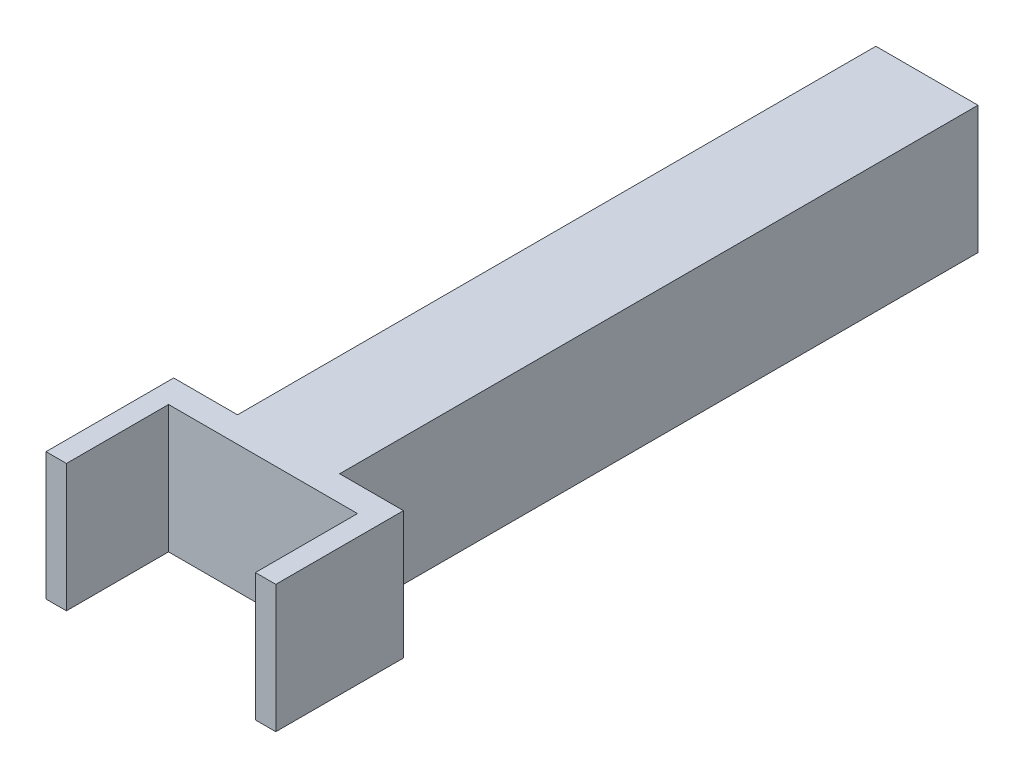
ISO-10303-21;
HEADER;
FILE_DESCRIPTION(('STEP AP214'),'2;1');
FILE_NAME('part.step','',(''),(''),'','','');
FILE_SCHEMA(('AUTOMOTIVE_DESIGN { 1 0 10303 214 1 1 1 1 }'));
ENDSEC;
DATA;
#1=APPLICATION_CONTEXT('core data for automotive mechanical design processes');
#2=APPLICATION_PROTOCOL_DEFINITION('international standard','automotive_design',2000,#1);
#3=PRODUCT_CONTEXT('',#1,'mechanical');
#4=PRODUCT('Part','Part','',(#3));
#5=PRODUCT_RELATED_PRODUCT_CATEGORY('part','',(#4));
#6=PRODUCT_DEFINITION_FORMATION('','',#4);
#7=PRODUCT_DEFINITION_CONTEXT('part definition',#1,'design');
#8=PRODUCT_DEFINITION('design','',#6,#7);
#9=PRODUCT_DEFINITION_SHAPE('','',#8);
#10=(LENGTH_UNIT() NAMED_UNIT(*) SI_UNIT(.MILLI.,.METRE.));
#11=(NAMED_UNIT(*) PLANE_ANGLE_UNIT() SI_UNIT($,.RADIAN.));
#12=(NAMED_UNIT(*) SI_UNIT($,.STERADIAN.) SOLID_ANGLE_UNIT());
#13=UNCERTAINTY_MEASURE_WITH_UNIT(LENGTH_MEASURE(1.E-05),#10,'distance_accuracy_value','');
#14=(GEOMETRIC_REPRESENTATION_CONTEXT(3) GLOBAL_UNCERTAINTY_ASSIGNED_CONTEXT((#13)) GLOBAL_UNIT_ASSIGNED_CONTEXT((#10,
#11,#12)) REPRESENTATION_CONTEXT('',''));
#15=CARTESIAN_POINT('',(0.,0.,0.));
#16=DIRECTION('',(0.,0.,1.));
#17=DIRECTION('',(1.,0.,0.));
#18=AXIS2_PLACEMENT_3D('',#15,#16,#17);
#19=CARTESIAN_POINT('',(0.,0.,260.));
#20=DIRECTION('',(0.,0.,-1.));
#21=DIRECTION('',(-1.,0.,0.));
#22=AXIS2_PLACEMENT_3D('',#19,#20,#21);
#23=PLANE('',#22);
#24=DIRECTION('',(0.,-1.,0.));
#25=VECTOR('',#24,1.);
#26=CARTESIAN_POINT('',(37.,25.,260.));
#27=LINE('',#26,#25);
#28=CARTESIAN_POINT('',(37.,25.,260.));
#29=VERTEX_POINT('',#28);
#30=CARTESIAN_POINT('',(37.,-25.,260.));
#31=VERTEX_POINT('',#30);
#32=EDGE_CURVE('E52',#29,#31,#27,.T.);
#33=ORIENTED_EDGE('',*,*,#32,.F.);
#34=DIRECTION('',(-1.,0.,0.));
#35=VECTOR('',#34,1.);
#36=CARTESIAN_POINT('',(45.,25.,260.));
#37=LINE('',#36,#35);
#38=CARTESIAN_POINT('',(-37.,25.,260.));
#39=VERTEX_POINT('',#38);
#40=EDGE_CURVE('E143',#29,#39,#37,.T.);
#41=ORIENTED_EDGE('',*,*,#40,.T.);
#42=DIRECTION('',(0.,1.,0.));
#43=VECTOR('',#42,1.);
#44=CARTESIAN_POINT('',(-37.,25.,260.));
#45=LINE('',#44,#43);
#46=CARTESIAN_POINT('',(-37.,-25.,260.));
#47=VERTEX_POINT('',#46);
#48=EDGE_CURVE('E144',#47,#39,#45,.T.);
#49=ORIENTED_EDGE('',*,*,#48,.F.);
#50=DIRECTION('',(1.,0.,0.));
#51=VECTOR('',#50,1.);
#52=CARTESIAN_POINT('',(45.,-25.,260.));
#53=LINE('',#52,#51);
#54=EDGE_CURVE('E48',#47,#31,#53,.T.);
#55=ORIENTED_EDGE('',*,*,#54,.T.);
#56=EDGE_LOOP('',(#33,#41,#49,#55));
#57=FACE_BOUND('',#56,.T.);
#58=ADVANCED_FACE('F33',(#57),#23,.F.);
#59=CARTESIAN_POINT('',(-20.,25.,250.));
#60=DIRECTION('',(1.,0.,0.));
#61=DIRECTION('',(0.,1.,0.));
#62=AXIS2_PLACEMENT_3D('',#59,#60,#61);
#63=PLANE('',#62);
#64=DIRECTION('',(0.,-1.,0.));
#65=VECTOR('',#64,1.);
#66=CARTESIAN_POINT('',(-20.,25.,0.));
#67=LINE('',#66,#65);
#68=CARTESIAN_POINT('',(-20.,25.,0.));
#69=VERTEX_POINT('',#68);
#70=CARTESIAN_POINT('',(-20.,-25.,0.));
#71=VERTEX_POINT('',#70);
#72=EDGE_CURVE('E192',#69,#71,#67,.T.);
#73=ORIENTED_EDGE('',*,*,#72,.T.);
#74=DIRECTION('',(0.,0.,-1.));
#75=VECTOR('',#74,1.);
#76=CARTESIAN_POINT('',(-20.,-25.,250.));
#77=LINE('',#76,#75);
#78=CARTESIAN_POINT('',(-20.,-25.,250.));
#79=VERTEX_POINT('',#78);
#80=EDGE_CURVE('E11',#79,#71,#77,.T.);
#81=ORIENTED_EDGE('',*,*,#80,.F.);
#82=DIRECTION('',(0.,-1.,0.));
#83=VECTOR('',#82,1.);
#84=CARTESIAN_POINT('',(-20.,25.,250.));
#85=LINE('',#84,#83);
#86=CARTESIAN_POINT('',(-20.,25.,250.));
#87=VERTEX_POINT('',#86);
#88=EDGE_CURVE('E193',#87,#79,#85,.T.);
#89=ORIENTED_EDGE('',*,*,#88,.F.);
#90=DIRECTION('',(0.,0.,-1.));
#91=VECTOR('',#90,1.);
#92=CARTESIAN_POINT('',(-20.,25.,250.));
#93=LINE('',#92,#91);
#94=EDGE_CURVE('E200',#87,#69,#93,.T.);
#95=ORIENTED_EDGE('',*,*,#94,.T.);
#96=EDGE_LOOP('',(#73,#81,#89,#95));
#97=FACE_BOUND('',#96,.T.);
#98=ADVANCED_FACE('F35',(#97),#63,.F.);
#99=CARTESIAN_POINT('',(20.,-25.,250.));
#100=DIRECTION('',(0.,1.,0.));
#101=DIRECTION('',(-1.,0.,0.));
#102=AXIS2_PLACEMENT_3D('',#99,#100,#101);
#103=PLANE('',#102);
#104=DIRECTION('',(1.,0.,0.));
#105=VECTOR('',#104,1.);
#106=CARTESIAN_POINT('',(20.,-25.,0.));
#107=LINE('',#106,#105);
#108=CARTESIAN_POINT('',(20.,-25.,0.));
#109=VERTEX_POINT('',#108);
#110=EDGE_CURVE('E203',#71,#109,#107,.T.);
#111=ORIENTED_EDGE('',*,*,#110,.T.);
#112=DIRECTION('',(0.,0.,-1.));
#113=VECTOR('',#112,1.);
#114=CARTESIAN_POINT('',(20.,-25.,250.));
#115=LINE('',#114,#113);
#116=CARTESIAN_POINT('',(20.,-25.,250.));
#117=VERTEX_POINT('',#116);
#118=EDGE_CURVE('E41',#117,#109,#115,.T.);
#119=ORIENTED_EDGE('',*,*,#118,.F.);
#120=DIRECTION('',(1.,0.,0.));
#121=VECTOR('',#120,1.);
#122=CARTESIAN_POINT('',(45.,-25.,250.));
#123=LINE('',#122,#121);
#124=CARTESIAN_POINT('',(45.,-25.,250.));
#125=VERTEX_POINT('',#124);
#126=EDGE_CURVE('E173',#117,#125,#123,.T.);
#127=ORIENTED_EDGE('',*,*,#126,.T.);
#128=DIRECTION('',(0.,0.,-1.));
#129=VECTOR('',#128,1.);
#130=CARTESIAN_POINT('',(45.,-25.,260.));
#131=LINE('',#130,#129);
#132=CARTESIAN_POINT('',(45.,-25.,300.));
#133=VERTEX_POINT('',#132);
#134=EDGE_CURVE('E186',#133,#125,#131,.T.);
#135=ORIENTED_EDGE('',*,*,#134,.F.);
#136=DIRECTION('',(1.,0.,0.));
#137=VECTOR('',#136,1.);
#138=CARTESIAN_POINT('',(45.,-25.,300.));
#139=LINE('',#138,#137);
#140=CARTESIAN_POINT('',(37.,-25.,300.));
#141=VERTEX_POINT('',#140);
#142=EDGE_CURVE('E130',#141,#133,#139,.T.);
#143=ORIENTED_EDGE('',*,*,#142,.F.);
#144=DIRECTION('',(0.,0.,-1.));
#145=VECTOR('',#144,1.);
#146=CARTESIAN_POINT('',(37.,-25.,300.));
#147=LINE('',#146,#145);
#148=EDGE_CURVE('E126',#141,#31,#147,.T.);
#149=ORIENTED_EDGE('',*,*,#148,.T.);
#150=ORIENTED_EDGE('',*,*,#54,.F.);
#151=DIRECTION('',(0.,0.,-1.));
#152=VECTOR('',#151,1.);
#153=CARTESIAN_POINT('',(-37.,-25.,300.));
#154=LINE('',#153,#152);
#155=CARTESIAN_POINT('',(-37.,-25.,300.));
#156=VERTEX_POINT('',#155);
#157=EDGE_CURVE('E163',#156,#47,#154,.T.);
#158=ORIENTED_EDGE('',*,*,#157,.F.);
#159=DIRECTION('',(1.,0.,0.));
#160=VECTOR('',#159,1.);
#161=CARTESIAN_POINT('',(-45.,-25.,300.));
#162=LINE('',#161,#160);
#163=CARTESIAN_POINT('',(-45.,-25.,300.));
#164=VERTEX_POINT('',#163);
#165=EDGE_CURVE('E154',#164,#156,#162,.T.);
#166=ORIENTED_EDGE('',*,*,#165,.F.);
#167=DIRECTION('',(0.,0.,-1.));
#168=VECTOR('',#167,1.);
#169=CARTESIAN_POINT('',(-45.,-25.,260.));
#170=LINE('',#169,#168);
#171=CARTESIAN_POINT('',(-45.,-25.,250.));
#172=VERTEX_POINT('',#171);
#173=EDGE_CURVE('E189',#164,#172,#170,.T.);
#174=ORIENTED_EDGE('',*,*,#173,.T.);
#175=EDGE_CURVE('E174',#172,#79,#123,.T.);
#176=ORIENTED_EDGE('',*,*,#175,.T.);
#177=ORIENTED_EDGE('',*,*,#80,.T.);
#178=EDGE_LOOP('',(#111,#119,#127,#135,#143,#149,#150,#158,#166,#174,#176,#177));
#179=FACE_BOUND('',#178,.T.);
#180=ADVANCED_FACE('F241',(#179),#103,.F.);
#181=CARTESIAN_POINT('',(20.,25.,250.));
#182=DIRECTION('',(-1.,0.,0.));
#183=DIRECTION('',(0.,-1.,0.));
#184=AXIS2_PLACEMENT_3D('',#181,#182,#183);
#185=PLANE('',#184);
#186=DIRECTION('',(0.,1.,0.));
#187=VECTOR('',#186,1.);
#188=CARTESIAN_POINT('',(20.,25.,0.));
#189=LINE('',#188,#187);
#190=CARTESIAN_POINT('',(20.,25.,0.));
#191=VERTEX_POINT('',#190);
#192=EDGE_CURVE('E205',#109,#191,#189,.T.);
#193=ORIENTED_EDGE('',*,*,#192,.T.);
#194=DIRECTION('',(0.,0.,-1.));
#195=VECTOR('',#194,1.);
#196=CARTESIAN_POINT('',(20.,25.,250.));
#197=LINE('',#196,#195);
#198=CARTESIAN_POINT('',(20.,25.,250.));
#199=VERTEX_POINT('',#198);
#200=EDGE_CURVE('E210',#199,#191,#197,.T.);
#201=ORIENTED_EDGE('',*,*,#200,.F.);
#202=DIRECTION('',(0.,1.,0.));
#203=VECTOR('',#202,1.);
#204=CARTESIAN_POINT('',(20.,25.,250.));
#205=LINE('',#204,#203);
#206=EDGE_CURVE('E196',#117,#199,#205,.T.);
#207=ORIENTED_EDGE('',*,*,#206,.F.);
#208=ORIENTED_EDGE('',*,*,#118,.T.);
#209=EDGE_LOOP('',(#193,#201,#207,#208));
#210=FACE_BOUND('',#209,.T.);
#211=ADVANCED_FACE('F216',(#210),#185,.F.);
#212=CARTESIAN_POINT('',(20.,25.,250.));
#213=DIRECTION('',(0.,-1.,0.));
#214=DIRECTION('',(1.,0.,0.));
#215=AXIS2_PLACEMENT_3D('',#212,#213,#214);
#216=PLANE('',#215);
#217=DIRECTION('',(-1.,0.,0.));
#218=VECTOR('',#217,1.);
#219=CARTESIAN_POINT('',(20.,25.,0.));
#220=LINE('',#219,#218);
#221=EDGE_CURVE('E197',#191,#69,#220,.T.);
#222=ORIENTED_EDGE('',*,*,#221,.T.);
#223=ORIENTED_EDGE('',*,*,#94,.F.);
#224=DIRECTION('',(-1.,0.,0.));
#225=VECTOR('',#224,1.);
#226=CARTESIAN_POINT('',(45.,25.,250.));
#227=LINE('',#226,#225);
#228=CARTESIAN_POINT('',(-45.,25.,250.));
#229=VERTEX_POINT('',#228);
#230=EDGE_CURVE('E179',#87,#229,#227,.T.);
#231=ORIENTED_EDGE('',*,*,#230,.T.);
#232=DIRECTION('',(0.,0.,-1.));
#233=VECTOR('',#232,1.);
#234=CARTESIAN_POINT('',(-45.,25.,260.));
#235=LINE('',#234,#233);
#236=CARTESIAN_POINT('',(-45.,25.,300.));
#237=VERTEX_POINT('',#236);
#238=EDGE_CURVE('E170',#237,#229,#235,.T.);
#239=ORIENTED_EDGE('',*,*,#238,.F.);
#240=DIRECTION('',(-1.,0.,0.));
#241=VECTOR('',#240,1.);
#242=CARTESIAN_POINT('',(-45.,25.,300.));
#243=LINE('',#242,#241);
#244=CARTESIAN_POINT('',(-37.,25.,300.));
#245=VERTEX_POINT('',#244);
#246=EDGE_CURVE('E158',#245,#237,#243,.T.);
#247=ORIENTED_EDGE('',*,*,#246,.F.);
#248=DIRECTION('',(0.,0.,-1.));
#249=VECTOR('',#248,1.);
#250=CARTESIAN_POINT('',(-37.,25.,300.));
#251=LINE('',#250,#249);
#252=EDGE_CURVE('E160',#245,#39,#251,.T.);
#253=ORIENTED_EDGE('',*,*,#252,.T.);
#254=ORIENTED_EDGE('',*,*,#40,.F.);
#255=DIRECTION('',(0.,0.,-1.));
#256=VECTOR('',#255,1.);
#257=CARTESIAN_POINT('',(37.,25.,300.));
#258=LINE('',#257,#256);
#259=CARTESIAN_POINT('',(37.,25.,300.));
#260=VERTEX_POINT('',#259);
#261=EDGE_CURVE('E124',#260,#29,#258,.T.);
#262=ORIENTED_EDGE('',*,*,#261,.F.);
#263=DIRECTION('',(-1.,0.,0.));
#264=VECTOR('',#263,1.);
#265=CARTESIAN_POINT('',(45.,25.,300.));
#266=LINE('',#265,#264);
#267=CARTESIAN_POINT('',(45.,25.,300.));
#268=VERTEX_POINT('',#267);
#269=EDGE_CURVE('E131',#268,#260,#266,.T.);
#270=ORIENTED_EDGE('',*,*,#269,.F.);
#271=DIRECTION('',(0.,0.,-1.));
#272=VECTOR('',#271,1.);
#273=CARTESIAN_POINT('',(45.,25.,260.));
#274=LINE('',#273,#272);
#275=CARTESIAN_POINT('',(45.,25.,250.));
#276=VERTEX_POINT('',#275);
#277=EDGE_CURVE('E184',#268,#276,#274,.T.);
#278=ORIENTED_EDGE('',*,*,#277,.T.);
#279=EDGE_CURVE('E168',#276,#199,#227,.T.);
#280=ORIENTED_EDGE('',*,*,#279,.T.);
#281=ORIENTED_EDGE('',*,*,#200,.T.);
#282=EDGE_LOOP('',(#222,#223,#231,#239,#247,#253,#254,#262,#270,#278,#280,#281));
#283=FACE_BOUND('',#282,.T.);
#284=ADVANCED_FACE('F141',(#283),#216,.F.);
#285=CARTESIAN_POINT('',(0.,0.,0.));
#286=DIRECTION('',(0.,0.,-1.));
#287=DIRECTION('',(-1.,0.,0.));
#288=AXIS2_PLACEMENT_3D('',#285,#286,#287);
#289=PLANE('',#288);
#290=ORIENTED_EDGE('',*,*,#72,.F.);
#291=ORIENTED_EDGE('',*,*,#221,.F.);
#292=ORIENTED_EDGE('',*,*,#192,.F.);
#293=ORIENTED_EDGE('',*,*,#110,.F.);
#294=EDGE_LOOP('',(#290,#291,#292,#293));
#295=FACE_BOUND('',#294,.T.);
#296=ADVANCED_FACE('F222',(#295),#289,.T.);
#297=CARTESIAN_POINT('',(0.,0.,250.));
#298=DIRECTION('',(0.,0.,-1.));
#299=DIRECTION('',(-1.,0.,0.));
#300=AXIS2_PLACEMENT_3D('',#297,#298,#299);
#301=PLANE('',#300);
#302=ORIENTED_EDGE('',*,*,#230,.F.);
#303=ORIENTED_EDGE('',*,*,#88,.T.);
#304=ORIENTED_EDGE('',*,*,#175,.F.);
#305=DIRECTION('',(0.,-1.,0.));
#306=VECTOR('',#305,1.);
#307=CARTESIAN_POINT('',(-45.,25.,250.));
#308=LINE('',#307,#306);
#309=EDGE_CURVE('E166',#229,#172,#308,.T.);
#310=ORIENTED_EDGE('',*,*,#309,.F.);
#311=EDGE_LOOP('',(#302,#303,#304,#310));
#312=FACE_BOUND('',#311,.T.);
#313=ADVANCED_FACE('F228',(#312),#301,.T.);
#314=CARTESIAN_POINT('',(-45.,25.,260.));
#315=DIRECTION('',(1.,0.,0.));
#316=DIRECTION('',(0.,1.,0.));
#317=AXIS2_PLACEMENT_3D('',#314,#315,#316);
#318=PLANE('',#317);
#319=ORIENTED_EDGE('',*,*,#309,.T.);
#320=ORIENTED_EDGE('',*,*,#173,.F.);
#321=DIRECTION('',(0.,-1.,0.));
#322=VECTOR('',#321,1.);
#323=CARTESIAN_POINT('',(-45.,25.,300.));
#324=LINE('',#323,#322);
#325=EDGE_CURVE('E147',#237,#164,#324,.T.);
#326=ORIENTED_EDGE('',*,*,#325,.F.);
#327=ORIENTED_EDGE('',*,*,#238,.T.);
#328=EDGE_LOOP('',(#319,#320,#326,#327));
#329=FACE_BOUND('',#328,.T.);
#330=ADVANCED_FACE('F232',(#329),#318,.F.);
#331=CARTESIAN_POINT('',(45.,25.,260.));
#332=DIRECTION('',(-1.,0.,0.));
#333=DIRECTION('',(0.,0.,1.));
#334=AXIS2_PLACEMENT_3D('',#331,#332,#333);
#335=PLANE('',#334);
#336=DIRECTION('',(0.,1.,0.));
#337=VECTOR('',#336,1.);
#338=CARTESIAN_POINT('',(45.,25.,250.));
#339=LINE('',#338,#337);
#340=EDGE_CURVE('E177',#125,#276,#339,.T.);
#341=ORIENTED_EDGE('',*,*,#340,.T.);
#342=ORIENTED_EDGE('',*,*,#277,.F.);
#343=DIRECTION('',(0.,1.,0.));
#344=VECTOR('',#343,1.);
#345=CARTESIAN_POINT('',(45.,25.,300.));
#346=LINE('',#345,#344);
#347=EDGE_CURVE('E137',#133,#268,#346,.T.);
#348=ORIENTED_EDGE('',*,*,#347,.F.);
#349=ORIENTED_EDGE('',*,*,#134,.T.);
#350=EDGE_LOOP('',(#341,#342,#348,#349));
#351=FACE_BOUND('',#350,.T.);
#352=ADVANCED_FACE('F245',(#351),#335,.F.);
#353=ORIENTED_EDGE('',*,*,#126,.F.);
#354=ORIENTED_EDGE('',*,*,#206,.T.);
#355=ORIENTED_EDGE('',*,*,#279,.F.);
#356=ORIENTED_EDGE('',*,*,#340,.F.);
#357=EDGE_LOOP('',(#353,#354,#355,#356));
#358=FACE_BOUND('',#357,.T.);
#359=ADVANCED_FACE('F249',(#358),#301,.T.);
#360=CARTESIAN_POINT('',(-37.,25.,300.));
#361=DIRECTION('',(-1.,0.,0.));
#362=DIRECTION('',(0.,0.,1.));
#363=AXIS2_PLACEMENT_3D('',#360,#361,#362);
#364=PLANE('',#363);
#365=ORIENTED_EDGE('',*,*,#48,.T.);
#366=ORIENTED_EDGE('',*,*,#252,.F.);
#367=DIRECTION('',(0.,1.,0.));
#368=VECTOR('',#367,1.);
#369=CARTESIAN_POINT('',(-37.,25.,300.));
#370=LINE('',#369,#368);
#371=EDGE_CURVE('E156',#156,#245,#370,.T.);
#372=ORIENTED_EDGE('',*,*,#371,.F.);
#373=ORIENTED_EDGE('',*,*,#157,.T.);
#374=EDGE_LOOP('',(#365,#366,#372,#373));
#375=FACE_BOUND('',#374,.T.);
#376=ADVANCED_FACE('F240',(#375),#364,.F.);
#377=CARTESIAN_POINT('',(0.,0.,300.));
#378=DIRECTION('',(0.,0.,1.));
#379=DIRECTION('',(1.,0.,0.));
#380=AXIS2_PLACEMENT_3D('',#377,#378,#379);
#381=PLANE('',#380);
#382=ORIENTED_EDGE('',*,*,#325,.T.);
#383=ORIENTED_EDGE('',*,*,#165,.T.);
#384=ORIENTED_EDGE('',*,*,#371,.T.);
#385=ORIENTED_EDGE('',*,*,#246,.T.);
#386=EDGE_LOOP('',(#382,#383,#384,#385));
#387=FACE_BOUND('',#386,.T.);
#388=ADVANCED_FACE('F235',(#387),#381,.T.);
#389=CARTESIAN_POINT('',(37.,25.,300.));
#390=DIRECTION('',(1.,0.,0.));
#391=DIRECTION('',(0.,0.,-1.));
#392=AXIS2_PLACEMENT_3D('',#389,#390,#391);
#393=PLANE('',#392);
#394=ORIENTED_EDGE('',*,*,#32,.T.);
#395=ORIENTED_EDGE('',*,*,#148,.F.);
#396=DIRECTION('',(0.,-1.,0.));
#397=VECTOR('',#396,1.);
#398=CARTESIAN_POINT('',(37.,25.,300.));
#399=LINE('',#398,#397);
#400=EDGE_CURVE('E120',#260,#141,#399,.T.);
#401=ORIENTED_EDGE('',*,*,#400,.F.);
#402=ORIENTED_EDGE('',*,*,#261,.T.);
#403=EDGE_LOOP('',(#394,#395,#401,#402));
#404=FACE_BOUND('',#403,.T.);
#405=ADVANCED_FACE('F122',(#404),#393,.F.);
#406=CARTESIAN_POINT('',(0.,0.,300.));
#407=DIRECTION('',(0.,0.,1.));
#408=DIRECTION('',(1.,0.,0.));
#409=AXIS2_PLACEMENT_3D('',#406,#407,#408);
#410=PLANE('',#409);
#411=ORIENTED_EDGE('',*,*,#269,.T.);
#412=ORIENTED_EDGE('',*,*,#400,.T.);
#413=ORIENTED_EDGE('',*,*,#142,.T.);
#414=ORIENTED_EDGE('',*,*,#347,.T.);
#415=EDGE_LOOP('',(#411,#412,#413,#414));
#416=FACE_BOUND('',#415,.T.);
#417=ADVANCED_FACE('F135',(#416),#410,.T.);
#418=CLOSED_SHELL('',(#58,#98,#180,#211,#284,#296,#313,#330,#352,#359,#376,#388,#405,#417));
#419=MANIFOLD_SOLID_BREP('B2',#418);
#420=ADVANCED_BREP_SHAPE_REPRESENTATION('',(#18,#419),#14);
#421=SHAPE_DEFINITION_REPRESENTATION(#9,#420);
ENDSEC;
END-ISO-10303-21;
